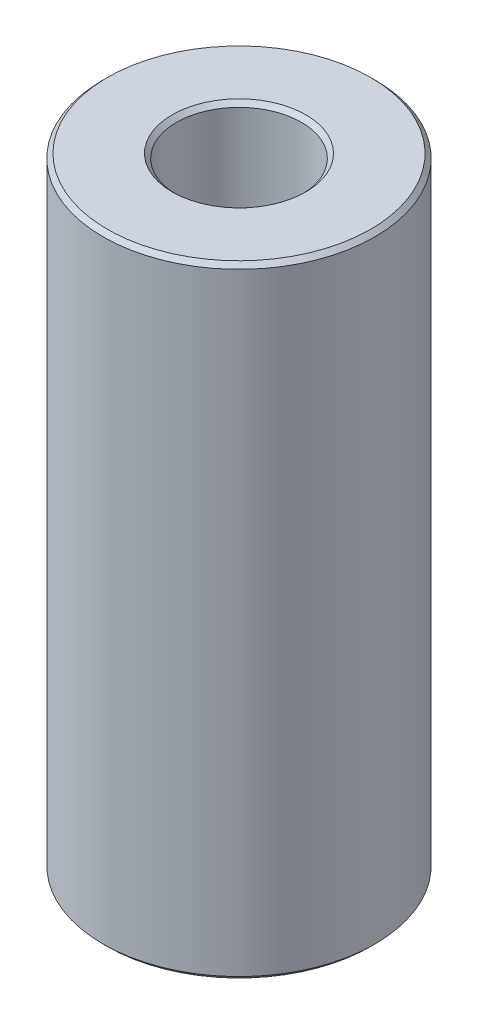
ISO-10303-21;
HEADER;
FILE_DESCRIPTION(('STEP AP214'),'2;1');
FILE_NAME('part.step','',(''),(''),'','','');
FILE_SCHEMA(('AUTOMOTIVE_DESIGN { 1 0 10303 214 1 1 1 1 }'));
ENDSEC;
DATA;
#1=APPLICATION_CONTEXT('core data for automotive mechanical design processes');
#2=APPLICATION_PROTOCOL_DEFINITION('international standard','automotive_design',2000,#1);
#3=PRODUCT_CONTEXT('',#1,'mechanical');
#4=PRODUCT('Part','Part','',(#3));
#5=PRODUCT_RELATED_PRODUCT_CATEGORY('part','',(#4));
#6=PRODUCT_DEFINITION_FORMATION('','',#4);
#7=PRODUCT_DEFINITION_CONTEXT('part definition',#1,'design');
#8=PRODUCT_DEFINITION('design','',#6,#7);
#9=PRODUCT_DEFINITION_SHAPE('','',#8);
#10=(LENGTH_UNIT() NAMED_UNIT(*) SI_UNIT(.MILLI.,.METRE.));
#11=(NAMED_UNIT(*) PLANE_ANGLE_UNIT() SI_UNIT($,.RADIAN.));
#12=(NAMED_UNIT(*) SI_UNIT($,.STERADIAN.) SOLID_ANGLE_UNIT());
#13=UNCERTAINTY_MEASURE_WITH_UNIT(LENGTH_MEASURE(1.E-05),#10,'distance_accuracy_value','');
#14=(GEOMETRIC_REPRESENTATION_CONTEXT(3) GLOBAL_UNCERTAINTY_ASSIGNED_CONTEXT((#13)) GLOBAL_UNIT_ASSIGNED_CONTEXT((#10,
#11,#12)) REPRESENTATION_CONTEXT('',''));
#15=CARTESIAN_POINT('',(0.,0.,0.));
#16=DIRECTION('',(0.,0.,1.));
#17=DIRECTION('',(1.,0.,0.));
#18=AXIS2_PLACEMENT_3D('',#15,#16,#17);
#19=CARTESIAN_POINT('',(0.,217.077506229163,0.));
#20=DIRECTION('',(0.,-1.,0.));
#21=DIRECTION('',(0.,0.,-1.));
#22=AXIS2_PLACEMENT_3D('',#19,#20,#21);
#23=CYLINDRICAL_SURFACE('',#22,47.5);
#24=CARTESIAN_POINT('',(0.,1.5177934359506,0.));
#25=DIRECTION('',(0.,1.,0.));
#26=DIRECTION('',(0.,0.,1.));
#27=AXIS2_PLACEMENT_3D('',#24,#25,#26);
#28=CIRCLE('',#27,47.5);
#29=CARTESIAN_POINT('',(0.,1.5177934359506,47.5));
#30=VERTEX_POINT('',#29);
#31=EDGE_CURVE('E10',#30,#30,#28,.T.);
#32=ORIENTED_EDGE('',*,*,#31,.T.);
#33=EDGE_LOOP('',(#32));
#34=FACE_BOUND('',#33,.T.);
#35=CARTESIAN_POINT('',(0.,215.559712793212,0.));
#36=DIRECTION('',(0.,1.,0.));
#37=DIRECTION('',(0.,0.,1.));
#38=AXIS2_PLACEMENT_3D('',#35,#36,#37);
#39=CIRCLE('',#38,47.5);
#40=CARTESIAN_POINT('',(0.,215.559712793212,-47.5));
#41=VERTEX_POINT('',#40);
#42=EDGE_CURVE('E50',#41,#41,#39,.F.);
#43=ORIENTED_EDGE('',*,*,#42,.T.);
#44=EDGE_LOOP('',(#43));
#45=FACE_BOUND('',#44,.T.);
#46=ADVANCED_FACE('F39',(#34,#45),#23,.T.);
#47=CARTESIAN_POINT('',(0.,217.077506229163,0.));
#48=DIRECTION('',(0.,1.,0.));
#49=DIRECTION('',(0.,0.,1.));
#50=AXIS2_PLACEMENT_3D('',#47,#48,#49);
#51=PLANE('',#50);
#52=CARTESIAN_POINT('',(0.,217.077506229163,0.));
#53=DIRECTION('',(0.,1.,0.));
#54=DIRECTION('',(0.,0.,1.));
#55=AXIS2_PLACEMENT_3D('',#52,#53,#54);
#56=CIRCLE('',#55,23.3638282328651);
#57=CARTESIAN_POINT('',(0.,217.077506229163,23.3638282328651));
#58=VERTEX_POINT('',#57);
#59=EDGE_CURVE('E58',#58,#58,#56,.F.);
#60=ORIENTED_EDGE('',*,*,#59,.T.);
#61=EDGE_LOOP('',(#60));
#62=FACE_BOUND('',#61,.T.);
#63=CARTESIAN_POINT('',(0.,217.077506229163,0.));
#64=DIRECTION('',(0.,1.,0.));
#65=DIRECTION('',(0.,0.,1.));
#66=AXIS2_PLACEMENT_3D('',#63,#64,#65);
#67=CIRCLE('',#66,45.9822065640494);
#68=CARTESIAN_POINT('',(0.,217.077506229163,-45.9822065640494));
#69=VERTEX_POINT('',#68);
#70=EDGE_CURVE('E61',#69,#69,#67,.T.);
#71=ORIENTED_EDGE('',*,*,#70,.T.);
#72=EDGE_LOOP('',(#71));
#73=FACE_BOUND('',#72,.T.);
#74=ADVANCED_FACE('F88',(#62,#73),#51,.T.);
#75=CARTESIAN_POINT('',(0.,0.,0.));
#76=DIRECTION('',(0.,1.,0.));
#77=DIRECTION('',(0.,0.,1.));
#78=AXIS2_PLACEMENT_3D('',#75,#76,#77);
#79=PLANE('',#78);
#80=CARTESIAN_POINT('',(0.,0.,0.));
#81=DIRECTION('',(0.,1.,0.));
#82=DIRECTION('',(0.,0.,1.));
#83=AXIS2_PLACEMENT_3D('',#80,#81,#82);
#84=CIRCLE('',#83,23.3638282328651);
#85=CARTESIAN_POINT('',(0.,0.,23.3638282328651));
#86=VERTEX_POINT('',#85);
#87=EDGE_CURVE('E51',#86,#86,#84,.T.);
#88=ORIENTED_EDGE('',*,*,#87,.T.);
#89=EDGE_LOOP('',(#88));
#90=FACE_BOUND('',#89,.T.);
#91=CARTESIAN_POINT('',(0.,0.,0.));
#92=DIRECTION('',(0.,1.,0.));
#93=DIRECTION('',(0.,0.,1.));
#94=AXIS2_PLACEMENT_3D('',#91,#92,#93);
#95=CIRCLE('',#94,45.9822065640494);
#96=CARTESIAN_POINT('',(0.,0.,45.9822065640494));
#97=VERTEX_POINT('',#96);
#98=EDGE_CURVE('E54',#97,#97,#95,.F.);
#99=ORIENTED_EDGE('',*,*,#98,.T.);
#100=EDGE_LOOP('',(#99));
#101=FACE_BOUND('',#100,.T.);
#102=ADVANCED_FACE('F83',(#90,#101),#79,.F.);
#103=CARTESIAN_POINT('',(0.,217.077506229163,0.));
#104=DIRECTION('',(0.,-1.,0.));
#105=DIRECTION('',(0.,0.,-1.));
#106=AXIS2_PLACEMENT_3D('',#103,#104,#105);
#107=CYLINDRICAL_SURFACE('',#106,21.8460347969144);
#108=CARTESIAN_POINT('',(0.,215.559712793212,0.));
#109=DIRECTION('',(0.,1.,0.));
#110=DIRECTION('',(0.,0.,1.));
#111=AXIS2_PLACEMENT_3D('',#108,#109,#110);
#112=CIRCLE('',#111,21.8460347969144);
#113=CARTESIAN_POINT('',(0.,215.559712793212,21.8460347969144));
#114=VERTEX_POINT('',#113);
#115=EDGE_CURVE('E67',#114,#114,#112,.T.);
#116=ORIENTED_EDGE('',*,*,#115,.T.);
#117=EDGE_LOOP('',(#116));
#118=FACE_BOUND('',#117,.T.);
#119=CARTESIAN_POINT('',(0.,1.51779343595063,0.));
#120=DIRECTION('',(0.,1.,0.));
#121=DIRECTION('',(0.,0.,1.));
#122=AXIS2_PLACEMENT_3D('',#119,#120,#121);
#123=CIRCLE('',#122,21.8460347969144);
#124=CARTESIAN_POINT('',(0.,1.51779343595063,21.8460347969144));
#125=VERTEX_POINT('',#124);
#126=EDGE_CURVE('E69',#125,#125,#123,.F.);
#127=ORIENTED_EDGE('',*,*,#126,.T.);
#128=EDGE_LOOP('',(#127));
#129=FACE_BOUND('',#128,.T.);
#130=ADVANCED_FACE('F71',(#118,#129),#107,.F.);
#131=CARTESIAN_POINT('',(0.,215.559712793212,0.));
#132=DIRECTION('',(0.,1.,0.));
#133=DIRECTION('',(0.,0.,1.));
#134=AXIS2_PLACEMENT_3D('',#131,#132,#133);
#135=CONICAL_SURFACE('',#134,21.8460347969144,0.785398163397446);
#136=ORIENTED_EDGE('',*,*,#59,.F.);
#137=EDGE_LOOP('',(#136));
#138=FACE_BOUND('',#137,.T.);
#139=ORIENTED_EDGE('',*,*,#115,.F.);
#140=EDGE_LOOP('',(#139));
#141=FACE_BOUND('',#140,.T.);
#142=ADVANCED_FACE('F77',(#138,#141),#135,.F.);
#143=CARTESIAN_POINT('',(0.,0.,0.));
#144=DIRECTION('',(0.,-1.,0.));
#145=DIRECTION('',(0.,0.,-1.));
#146=AXIS2_PLACEMENT_3D('',#143,#144,#145);
#147=CONICAL_SURFACE('',#146,23.3638282328651,0.785398163397446);
#148=ORIENTED_EDGE('',*,*,#126,.F.);
#149=EDGE_LOOP('',(#148));
#150=FACE_BOUND('',#149,.T.);
#151=ORIENTED_EDGE('',*,*,#87,.F.);
#152=EDGE_LOOP('',(#151));
#153=FACE_BOUND('',#152,.T.);
#154=ADVANCED_FACE('F73',(#150,#153),#147,.F.);
#155=CARTESIAN_POINT('',(0.,1.5177934359506,0.));
#156=DIRECTION('',(0.,1.,0.));
#157=DIRECTION('',(0.,0.,1.));
#158=AXIS2_PLACEMENT_3D('',#155,#156,#157);
#159=CONICAL_SURFACE('',#158,47.5,0.785398163397446);
#160=ORIENTED_EDGE('',*,*,#98,.F.);
#161=EDGE_LOOP('',(#160));
#162=FACE_BOUND('',#161,.T.);
#163=ORIENTED_EDGE('',*,*,#31,.F.);
#164=EDGE_LOOP('',(#163));
#165=FACE_BOUND('',#164,.T.);
#166=ADVANCED_FACE('F76',(#162,#165),#159,.T.);
#167=CARTESIAN_POINT('',(0.,217.077506229163,0.));
#168=DIRECTION('',(0.,-1.,0.));
#169=DIRECTION('',(0.,0.,-1.));
#170=AXIS2_PLACEMENT_3D('',#167,#168,#169);
#171=CONICAL_SURFACE('',#170,45.9822065640494,0.785398163397457);
#172=CARTESIAN_POINT('',(0.,215.559712793212,-47.5));
#173=CARTESIAN_POINT('',(0.,215.575523141503,-47.4841896517089));
#174=CARTESIAN_POINT('',(0.,215.591333489795,-47.4683793034177));
#175=CARTESIAN_POINT('',(0.,215.622954186377,-47.4367586068354));
#176=CARTESIAN_POINT('',(0.,215.638764534668,-47.4209482585443));
#177=CARTESIAN_POINT('',(0.,215.67038523125,-47.389327561962));
#178=CARTESIAN_POINT('',(0.,215.686195579542,-47.3735172136708));
#179=CARTESIAN_POINT('',(0.,215.717816276124,-47.3418965170885));
#180=CARTESIAN_POINT('',(0.,215.733626624415,-47.3260861687973));
#181=CARTESIAN_POINT('',(0.,215.765247320997,-47.294465472215));
#182=CARTESIAN_POINT('',(0.,215.781057669288,-47.2786551239239));
#183=CARTESIAN_POINT('',(0.,215.812678365871,-47.2470344273416));
#184=CARTESIAN_POINT('',(0.,215.828488714162,-47.2312240790504));
#185=CARTESIAN_POINT('',(0.,215.860109410744,-47.1996033824681));
#186=CARTESIAN_POINT('',(0.,215.875919759035,-47.183793034177));
#187=CARTESIAN_POINT('',(0.,215.907540455618,-47.1521723375947));
#188=CARTESIAN_POINT('',(0.,215.923350803909,-47.1363619893035));
#189=CARTESIAN_POINT('',(0.,215.954971500491,-47.1047412927212));
#190=CARTESIAN_POINT('',(0.,215.970781848782,-47.0889309444301));
#191=CARTESIAN_POINT('',(0.,216.002402545365,-47.0573102478478));
#192=CARTESIAN_POINT('',(0.,216.018212893656,-47.0414998995566));
#193=CARTESIAN_POINT('',(0.,216.049833590238,-47.0098792029743));
#194=CARTESIAN_POINT('',(0.,216.065643938529,-46.9940688546832));
#195=CARTESIAN_POINT('',(0.,216.097264635111,-46.9624481581009));
#196=CARTESIAN_POINT('',(0.,216.113074983403,-46.9466378098097));
#197=CARTESIAN_POINT('',(0.,216.144695679985,-46.9150171132274));
#198=CARTESIAN_POINT('',(0.,216.160506028276,-46.8992067649362));
#199=CARTESIAN_POINT('',(0.,216.192126724858,-46.8675860683539));
#200=CARTESIAN_POINT('',(0.,216.20793707315,-46.8517757200628));
#201=CARTESIAN_POINT('',(0.,216.239557769732,-46.8201550234805));
#202=CARTESIAN_POINT('',(0.,216.255368118023,-46.8043446751893));
#203=CARTESIAN_POINT('',(0.,216.286988814605,-46.772723978607));
#204=CARTESIAN_POINT('',(0.,216.302799162896,-46.7569136303159));
#205=CARTESIAN_POINT('',(0.,216.334419859479,-46.7252929337336));
#206=CARTESIAN_POINT('',(0.,216.35023020777,-46.7094825854424));
#207=CARTESIAN_POINT('',(0.,216.381850904352,-46.6778618888601));
#208=CARTESIAN_POINT('',(0.,216.397661252643,-46.662051540569));
#209=CARTESIAN_POINT('',(0.,216.429281949226,-46.6304308439867));
#210=CARTESIAN_POINT('',(0.,216.445092297517,-46.6146204956955));
#211=CARTESIAN_POINT('',(0.,216.476712994099,-46.5829997991132));
#212=CARTESIAN_POINT('',(0.,216.49252334239,-46.567189450822));
#213=CARTESIAN_POINT('',(0.,216.524144038973,-46.5355687542397));
#214=CARTESIAN_POINT('',(0.,216.539954387264,-46.5197584059486));
#215=CARTESIAN_POINT('',(0.,216.571575083846,-46.4881377093663));
#216=CARTESIAN_POINT('',(0.,216.587385432137,-46.4723273610751));
#217=CARTESIAN_POINT('',(0.,216.619006128719,-46.4407066644928));
#218=CARTESIAN_POINT('',(0.,216.634816477011,-46.4248963162017));
#219=CARTESIAN_POINT('',(0.,216.666437173593,-46.3932756196194));
#220=CARTESIAN_POINT('',(0.,216.682247521884,-46.3774652713282));
#221=CARTESIAN_POINT('',(0.,216.713868218466,-46.3458445747459));
#222=CARTESIAN_POINT('',(0.,216.729678566758,-46.3300342264548));
#223=CARTESIAN_POINT('',(0.,216.76129926334,-46.2984135298725));
#224=CARTESIAN_POINT('',(0.,216.777109611631,-46.2826031815813));
#225=CARTESIAN_POINT('',(0.,216.808730308213,-46.250982484999));
#226=CARTESIAN_POINT('',(0.,216.824540656504,-46.2351721367079));
#227=CARTESIAN_POINT('',(0.,216.856161353087,-46.2035514401256));
#228=CARTESIAN_POINT('',(0.,216.871971701378,-46.1877410918344));
#229=CARTESIAN_POINT('',(0.,216.90359239796,-46.1561203952521));
#230=CARTESIAN_POINT('',(0.,216.919402746251,-46.1403100469609));
#231=CARTESIAN_POINT('',(0.,216.951023442834,-46.1086893503786));
#232=CARTESIAN_POINT('',(0.,216.966833791125,-46.0928790020875));
#233=CARTESIAN_POINT('',(0.,216.998454487707,-46.0612583055052));
#234=CARTESIAN_POINT('',(0.,217.014264835998,-46.045447957214));
#235=CARTESIAN_POINT('',(0.,217.045885532581,-46.0138272606317));
#236=CARTESIAN_POINT('',(0.,217.061695880872,-45.9980169123406));
#237=CARTESIAN_POINT('',(0.,217.077506229163,-45.9822065640494));
#238=B_SPLINE_CURVE_WITH_KNOTS('',3,(#172,#173,#174,#175,#176,#177,#178,#179,#180,#181,#182,
#183,#184,#185,#186,#187,#188,#189,#190,#191,#192,#193,#194,#195,#196,#197,#198,#199,#200,#201,
#202,#203,#204,#205,#206,#207,#208,#209,#210,#211,#212,#213,#214,#215,#216,#217,#218,#219,#220,
#221,#222,#223,#224,#225,#226,#227,#228,#229,#230,#231,#232,#233,#234,#235,#236,#237),
.UNSPECIFIED.,.F.,.F.,(4,2,2,2,2,2,2,2,2,2,2,2,2,2,2,2,2,2,2,2,2,2,2,2,2,2,2,2,2,2,2,2,4),(0.,
0.0670776269375833,0.134155253875152,0.201232880812716,0.268310507750284,0.335388134687848,
0.402465761625417,0.46954338856298,0.536621015500549,0.603698642438113,0.670776269375681,
0.737853896313265,0.804931523250833,0.872009150188397,0.939086777125966,1.00616440406353,
1.0732420310011,1.14031965793866,1.20739728487623,1.27447491181379,1.34155253875136,
1.40863016568893,1.47570779262651,1.54278541956408,1.60986304650165,1.67694067343922,
1.74401830037678,1.81109592731435,1.87817355425191,1.94525118118948,2.01232880812704,
2.07940643506461,2.1464840620022),.UNSPECIFIED.);
#239=EDGE_CURVE('BSEAM45',#41,#69,#238,.T.);
#240=ORIENTED_EDGE('',*,*,#42,.F.);
#241=ORIENTED_EDGE('',*,*,#70,.F.);
#242=ORIENTED_EDGE('',*,*,#239,.T.);
#243=ORIENTED_EDGE('',*,*,#239,.F.);
#244=EDGE_LOOP('',(#240,#242,#241,#243));
#245=FACE_BOUND('',#244,.T.);
#246=ADVANCED_FACE('F45',(#245),#171,.T.);
#247=CLOSED_SHELL('',(#46,#74,#102,#130,#142,#154,#166,#246));
#248=MANIFOLD_SOLID_BREP('B2',#247);
#249=ADVANCED_BREP_SHAPE_REPRESENTATION('',(#18,#248),#14);
#250=SHAPE_DEFINITION_REPRESENTATION(#9,#249);
ENDSEC;
END-ISO-10303-21;
